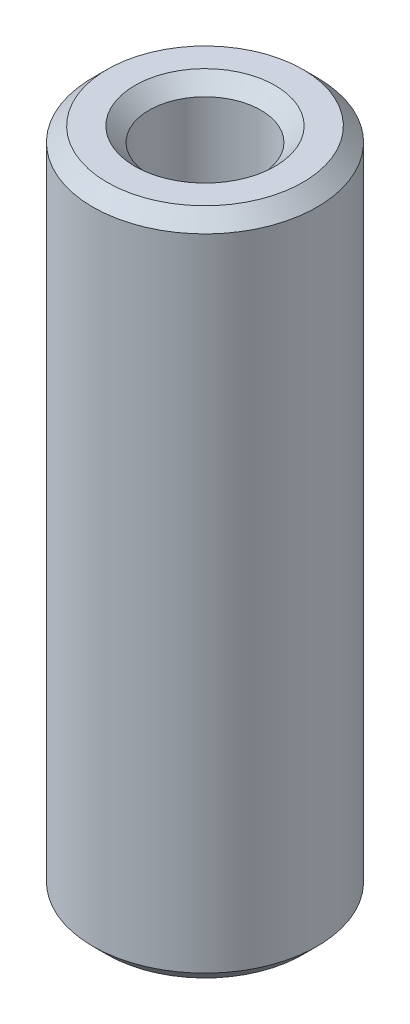
ISO-10303-21;
HEADER;
FILE_DESCRIPTION(('STEP AP214'),'2;1');
FILE_NAME('part.step','',(''),(''),'','','');
FILE_SCHEMA(('AUTOMOTIVE_DESIGN { 1 0 10303 214 1 1 1 1 }'));
ENDSEC;
DATA;
#1=APPLICATION_CONTEXT('core data for automotive mechanical design processes');
#2=APPLICATION_PROTOCOL_DEFINITION('international standard','automotive_design',2000,#1);
#3=PRODUCT_CONTEXT('',#1,'mechanical');
#4=PRODUCT('Part','Part','',(#3));
#5=PRODUCT_RELATED_PRODUCT_CATEGORY('part','',(#4));
#6=PRODUCT_DEFINITION_FORMATION('','',#4);
#7=PRODUCT_DEFINITION_CONTEXT('part definition',#1,'design');
#8=PRODUCT_DEFINITION('design','',#6,#7);
#9=PRODUCT_DEFINITION_SHAPE('','',#8);
#10=(LENGTH_UNIT() NAMED_UNIT(*) SI_UNIT(.MILLI.,.METRE.));
#11=(NAMED_UNIT(*) PLANE_ANGLE_UNIT() SI_UNIT($,.RADIAN.));
#12=(NAMED_UNIT(*) SI_UNIT($,.STERADIAN.) SOLID_ANGLE_UNIT());
#13=UNCERTAINTY_MEASURE_WITH_UNIT(LENGTH_MEASURE(1.E-05),#10,'distance_accuracy_value','');
#14=(GEOMETRIC_REPRESENTATION_CONTEXT(3) GLOBAL_UNCERTAINTY_ASSIGNED_CONTEXT((#13)) GLOBAL_UNIT_ASSIGNED_CONTEXT((#10,
#11,#12)) REPRESENTATION_CONTEXT('',''));
#15=CARTESIAN_POINT('',(0.,0.,0.));
#16=DIRECTION('',(0.,0.,1.));
#17=DIRECTION('',(1.,0.,0.));
#18=AXIS2_PLACEMENT_3D('',#15,#16,#17);
#19=CARTESIAN_POINT('',(0.,44.727620054621,0.));
#20=DIRECTION('',(0.,-1.,0.));
#21=DIRECTION('',(0.,0.,-1.));
#22=AXIS2_PLACEMENT_3D('',#19,#20,#21);
#23=CYLINDRICAL_SURFACE('',#22,7.5);
#24=CARTESIAN_POINT('',(0.,0.955096712856082,0.));
#25=DIRECTION('',(0.,1.,0.));
#26=DIRECTION('',(0.,0.,1.));
#27=AXIS2_PLACEMENT_3D('',#24,#25,#26);
#28=CIRCLE('',#27,7.5);
#29=CARTESIAN_POINT('',(0.,0.955096712856082,7.5));
#30=VERTEX_POINT('',#29);
#31=EDGE_CURVE('E10',#30,#30,#28,.T.);
#32=ORIENTED_EDGE('',*,*,#31,.T.);
#33=EDGE_LOOP('',(#32));
#34=FACE_BOUND('',#33,.T.);
#35=CARTESIAN_POINT('',(0.,43.7725233417649,0.));
#36=DIRECTION('',(0.,1.,0.));
#37=DIRECTION('',(0.,0.,1.));
#38=AXIS2_PLACEMENT_3D('',#35,#36,#37);
#39=CIRCLE('',#38,7.5);
#40=CARTESIAN_POINT('',(0.,43.7725233417649,7.5));
#41=VERTEX_POINT('',#40);
#42=EDGE_CURVE('E50',#41,#41,#39,.F.);
#43=ORIENTED_EDGE('',*,*,#42,.T.);
#44=EDGE_LOOP('',(#43));
#45=FACE_BOUND('',#44,.T.);
#46=ADVANCED_FACE('F39',(#34,#45),#23,.T.);
#47=CARTESIAN_POINT('',(0.,44.727620054621,0.));
#48=DIRECTION('',(0.,1.,0.));
#49=DIRECTION('',(0.,0.,1.));
#50=AXIS2_PLACEMENT_3D('',#47,#48,#49);
#51=PLANE('',#50);
#52=CARTESIAN_POINT('',(0.,44.727620054621,0.));
#53=DIRECTION('',(0.,1.,0.));
#54=DIRECTION('',(0.,0.,1.));
#55=AXIS2_PLACEMENT_3D('',#52,#53,#54);
#56=CIRCLE('',#55,4.68998011673796);
#57=CARTESIAN_POINT('',(0.,44.727620054621,4.68998011673796));
#58=VERTEX_POINT('',#57);
#59=EDGE_CURVE('E58',#58,#58,#56,.F.);
#60=ORIENTED_EDGE('',*,*,#59,.T.);
#61=EDGE_LOOP('',(#60));
#62=FACE_BOUND('',#61,.T.);
#63=CARTESIAN_POINT('',(0.,44.727620054621,0.));
#64=DIRECTION('',(0.,1.,0.));
#65=DIRECTION('',(0.,0.,1.));
#66=AXIS2_PLACEMENT_3D('',#63,#64,#65);
#67=CIRCLE('',#66,6.54490328714392);
#68=CARTESIAN_POINT('',(0.,44.727620054621,6.54490328714392));
#69=VERTEX_POINT('',#68);
#70=EDGE_CURVE('E61',#69,#69,#67,.T.);
#71=ORIENTED_EDGE('',*,*,#70,.T.);
#72=EDGE_LOOP('',(#71));
#73=FACE_BOUND('',#72,.T.);
#74=ADVANCED_FACE('F88',(#62,#73),#51,.T.);
#75=CARTESIAN_POINT('',(0.,0.,0.));
#76=DIRECTION('',(0.,1.,0.));
#77=DIRECTION('',(0.,0.,1.));
#78=AXIS2_PLACEMENT_3D('',#75,#76,#77);
#79=PLANE('',#78);
#80=CARTESIAN_POINT('',(0.,0.,0.));
#81=DIRECTION('',(0.,1.,0.));
#82=DIRECTION('',(0.,0.,1.));
#83=AXIS2_PLACEMENT_3D('',#80,#81,#82);
#84=CIRCLE('',#83,4.68998011673797);
#85=CARTESIAN_POINT('',(0.,0.,4.68998011673797));
#86=VERTEX_POINT('',#85);
#87=EDGE_CURVE('E51',#86,#86,#84,.T.);
#88=ORIENTED_EDGE('',*,*,#87,.T.);
#89=EDGE_LOOP('',(#88));
#90=FACE_BOUND('',#89,.T.);
#91=CARTESIAN_POINT('',(0.,0.,0.));
#92=DIRECTION('',(0.,1.,0.));
#93=DIRECTION('',(0.,0.,1.));
#94=AXIS2_PLACEMENT_3D('',#91,#92,#93);
#95=CIRCLE('',#94,6.54490328714391);
#96=CARTESIAN_POINT('',(0.,0.,6.54490328714391));
#97=VERTEX_POINT('',#96);
#98=EDGE_CURVE('E54',#97,#97,#95,.F.);
#99=ORIENTED_EDGE('',*,*,#98,.T.);
#100=EDGE_LOOP('',(#99));
#101=FACE_BOUND('',#100,.T.);
#102=ADVANCED_FACE('F83',(#90,#101),#79,.F.);
#103=CARTESIAN_POINT('',(0.,44.727620054621,0.));
#104=DIRECTION('',(0.,-1.,0.));
#105=DIRECTION('',(0.,0.,-1.));
#106=AXIS2_PLACEMENT_3D('',#103,#104,#105);
#107=CYLINDRICAL_SURFACE('',#106,3.7348834038819);
#108=CARTESIAN_POINT('',(0.,43.772523341765,0.));
#109=DIRECTION('',(0.,1.,0.));
#110=DIRECTION('',(0.,0.,1.));
#111=AXIS2_PLACEMENT_3D('',#108,#109,#110);
#112=CIRCLE('',#111,3.7348834038819);
#113=CARTESIAN_POINT('',(0.,43.772523341765,3.73488340388189));
#114=VERTEX_POINT('',#113);
#115=EDGE_CURVE('E67',#114,#114,#112,.T.);
#116=ORIENTED_EDGE('',*,*,#115,.T.);
#117=EDGE_LOOP('',(#116));
#118=FACE_BOUND('',#117,.T.);
#119=CARTESIAN_POINT('',(0.,0.955096712856089,0.));
#120=DIRECTION('',(0.,1.,0.));
#121=DIRECTION('',(0.,0.,1.));
#122=AXIS2_PLACEMENT_3D('',#119,#120,#121);
#123=CIRCLE('',#122,3.7348834038819);
#124=CARTESIAN_POINT('',(0.,0.955096712856089,3.7348834038819));
#125=VERTEX_POINT('',#124);
#126=EDGE_CURVE('E69',#125,#125,#123,.F.);
#127=ORIENTED_EDGE('',*,*,#126,.T.);
#128=EDGE_LOOP('',(#127));
#129=FACE_BOUND('',#128,.T.);
#130=ADVANCED_FACE('F71',(#118,#129),#107,.F.);
#131=CARTESIAN_POINT('',(0.,43.772523341765,0.));
#132=DIRECTION('',(0.,1.,0.));
#133=DIRECTION('',(0.,0.,1.));
#134=AXIS2_PLACEMENT_3D('',#131,#132,#133);
#135=CONICAL_SURFACE('',#134,3.7348834038819,0.785398163397447);
#136=CARTESIAN_POINT('',(0.,44.727620054621,4.68998011673796));
#137=CARTESIAN_POINT('',(0.,44.7176711305288,4.68003119264571));
#138=CARTESIAN_POINT('',(0.,44.7077222064365,4.67008226855346));
#139=CARTESIAN_POINT('',(0.,44.687824358252,4.65018442036896));
#140=CARTESIAN_POINT('',(0.,44.6778754341598,4.6402354962767));
#141=CARTESIAN_POINT('',(0.,44.6579775859753,4.6203376480922));
#142=CARTESIAN_POINT('',(0.,44.648028661883,4.61038872399995));
#143=CARTESIAN_POINT('',(0.,44.6281308136985,4.59049087581545));
#144=CARTESIAN_POINT('',(0.,44.6181818896063,4.5805419517232));
#145=CARTESIAN_POINT('',(0.,44.5982840414218,4.5606441035387));
#146=CARTESIAN_POINT('',(0.,44.5883351173295,4.55069517944645));
#147=CARTESIAN_POINT('',(0.,44.568437269145,4.53079733126195));
#148=CARTESIAN_POINT('',(0.,44.5584883450528,4.5208484071697));
#149=CARTESIAN_POINT('',(0.,44.5385904968683,4.5009505589852));
#150=CARTESIAN_POINT('',(0.,44.528641572776,4.49100163489294));
#151=CARTESIAN_POINT('',(0.,44.5087437245915,4.47110378670844));
#152=CARTESIAN_POINT('',(0.,44.4987948004993,4.46115486261619));
#153=CARTESIAN_POINT('',(0.,44.4788969523147,4.44125701443169));
#154=CARTESIAN_POINT('',(0.,44.4689480282225,4.43130809033944));
#155=CARTESIAN_POINT('',(0.,44.449050180038,4.41141024215494));
#156=CARTESIAN_POINT('',(0.,44.4391012559458,4.40146131806269));
#157=CARTESIAN_POINT('',(0.,44.4192034077613,4.38156346987819));
#158=CARTESIAN_POINT('',(0.,44.409254483669,4.37161454578594));
#159=CARTESIAN_POINT('',(0.,44.3893566354845,4.35171669760144));
#160=CARTESIAN_POINT('',(0.,44.3794077113922,4.34176777350919));
#161=CARTESIAN_POINT('',(0.,44.3595098632077,4.32186992532468));
#162=CARTESIAN_POINT('',(0.,44.3495609391155,4.31192100123243));
#163=CARTESIAN_POINT('',(0.,44.329663090931,4.29202315304793));
#164=CARTESIAN_POINT('',(0.,44.3197141668387,4.28207422895568));
#165=CARTESIAN_POINT('',(0.,44.2998163186542,4.26217638077118));
#166=CARTESIAN_POINT('',(0.,44.289867394562,4.25222745667893));
#167=CARTESIAN_POINT('',(0.,44.2699695463775,4.23232960849443));
#168=CARTESIAN_POINT('',(0.,44.2600206222852,4.22238068440218));
#169=CARTESIAN_POINT('',(0.,44.2401227741007,4.20248283621768));
#170=CARTESIAN_POINT('',(0.,44.2301738500085,4.19253391212543));
#171=CARTESIAN_POINT('',(0.,44.210276001824,4.17263606394092));
#172=CARTESIAN_POINT('',(0.,44.2003270777317,4.16268713984867));
#173=CARTESIAN_POINT('',(0.,44.1804292295472,4.14278929166417));
#174=CARTESIAN_POINT('',(0.,44.170480305455,4.13284036757192));
#175=CARTESIAN_POINT('',(0.,44.1505824572705,4.11294251938742));
#176=CARTESIAN_POINT('',(0.,44.1406335331782,4.10299359529517));
#177=CARTESIAN_POINT('',(0.,44.1207356849937,4.08309574711067));
#178=CARTESIAN_POINT('',(0.,44.1107867609015,4.07314682301842));
#179=CARTESIAN_POINT('',(0.,44.090888912717,4.05324897483391));
#180=CARTESIAN_POINT('',(0.,44.0809399886247,4.04330005074166));
#181=CARTESIAN_POINT('',(0.,44.0610421404402,4.02340220255716));
#182=CARTESIAN_POINT('',(0.,44.051093216348,4.01345327846491));
#183=CARTESIAN_POINT('',(0.,44.0311953681635,3.99355543028041));
#184=CARTESIAN_POINT('',(0.,44.0212464440712,3.98360650618816));
#185=CARTESIAN_POINT('',(0.,44.0013485958867,3.96370865800366));
#186=CARTESIAN_POINT('',(0.,43.9913996717945,3.95375973391141));
#187=CARTESIAN_POINT('',(0.,43.97150182361,3.93386188572691));
#188=CARTESIAN_POINT('',(0.,43.9615528995177,3.92391296163466));
#189=CARTESIAN_POINT('',(0.,43.9416550513332,3.90401511345015));
#190=CARTESIAN_POINT('',(0.,43.931706127241,3.8940661893579));
#191=CARTESIAN_POINT('',(0.,43.9118082790565,3.8741683411734));
#192=CARTESIAN_POINT('',(0.,43.9018593549642,3.86421941708115));
#193=CARTESIAN_POINT('',(0.,43.8819615067797,3.84432156889665));
#194=CARTESIAN_POINT('',(0.,43.8720125826875,3.8343726448044));
#195=CARTESIAN_POINT('',(0.,43.852114734503,3.8144747966199));
#196=CARTESIAN_POINT('',(0.,43.8421658104107,3.80452587252765));
#197=CARTESIAN_POINT('',(0.,43.8222679622262,3.78462802434315));
#198=CARTESIAN_POINT('',(0.,43.812319038134,3.7746791002509));
#199=CARTESIAN_POINT('',(0.,43.7924211899495,3.75478125206639));
#200=CARTESIAN_POINT('',(0.,43.7824722658572,3.74483232797414));
#201=CARTESIAN_POINT('',(0.,43.772523341765,3.73488340388189));
#202=B_SPLINE_CURVE_WITH_KNOTS('',3,(#136,#137,#138,#139,#140,#141,#142,#143,#144,#145,#146,
#147,#148,#149,#150,#151,#152,#153,#154,#155,#156,#157,#158,#159,#160,#161,#162,#163,#164,#165,
#166,#167,#168,#169,#170,#171,#172,#173,#174,#175,#176,#177,#178,#179,#180,#181,#182,#183,#184,
#185,#186,#187,#188,#189,#190,#191,#192,#193,#194,#195,#196,#197,#198,#199,#200,#201),
.UNSPECIFIED.,.F.,.F.,(4,2,2,2,2,2,2,2,2,2,2,2,2,2,2,2,2,2,2,2,2,2,2,2,2,2,2,2,2,2,2,2,4),(0.,
0.0422097101468423,0.0844194202936847,0.126629130440532,0.168838840587374,0.211048550734217,
0.253258260881064,0.295467971027906,0.337677681174753,0.379887391321595,0.422097101468437,
0.464306811615285,0.506516521762127,0.548726231908969,0.590935942055816,0.633145652202659,
0.675355362349506,0.717565072496348,0.759774782643191,0.801984492790038,0.84419420293688,
0.886403913083723,0.92861362323057,0.970823333377412,1.01303304352426,1.0552427536711,
1.09745246381794,1.13966217396479,1.18187188411163,1.22408159425848,1.26629130440532,
1.30850101455216,1.35071072469901),.UNSPECIFIED.);
#203=EDGE_CURVE('BSEAM77',#58,#114,#202,.T.);
#204=ORIENTED_EDGE('',*,*,#59,.F.);
#205=ORIENTED_EDGE('',*,*,#115,.F.);
#206=ORIENTED_EDGE('',*,*,#203,.T.);
#207=ORIENTED_EDGE('',*,*,#203,.F.);
#208=EDGE_LOOP('',(#204,#206,#205,#207));
#209=FACE_BOUND('',#208,.T.);
#210=ADVANCED_FACE('F77',(#209),#135,.F.);
#211=CARTESIAN_POINT('',(0.,0.,0.));
#212=DIRECTION('',(0.,-1.,0.));
#213=DIRECTION('',(0.,0.,-1.));
#214=AXIS2_PLACEMENT_3D('',#211,#212,#213);
#215=CONICAL_SURFACE('',#214,4.68998011673797,0.78539816339744);
#216=ORIENTED_EDGE('',*,*,#126,.F.);
#217=EDGE_LOOP('',(#216));
#218=FACE_BOUND('',#217,.T.);
#219=ORIENTED_EDGE('',*,*,#87,.F.);
#220=EDGE_LOOP('',(#219));
#221=FACE_BOUND('',#220,.T.);
#222=ADVANCED_FACE('F73',(#218,#221),#215,.F.);
#223=CARTESIAN_POINT('',(0.,0.955096712856082,0.));
#224=DIRECTION('',(0.,1.,0.));
#225=DIRECTION('',(0.,0.,1.));
#226=AXIS2_PLACEMENT_3D('',#223,#224,#225);
#227=CONICAL_SURFACE('',#226,7.5,0.78539816339745);
#228=ORIENTED_EDGE('',*,*,#98,.F.);
#229=EDGE_LOOP('',(#228));
#230=FACE_BOUND('',#229,.T.);
#231=ORIENTED_EDGE('',*,*,#31,.F.);
#232=EDGE_LOOP('',(#231));
#233=FACE_BOUND('',#232,.T.);
#234=ADVANCED_FACE('F76',(#230,#233),#227,.T.);
#235=CARTESIAN_POINT('',(0.,44.727620054621,0.));
#236=DIRECTION('',(0.,-1.,0.));
#237=DIRECTION('',(0.,0.,-1.));
#238=AXIS2_PLACEMENT_3D('',#235,#236,#237);
#239=CONICAL_SURFACE('',#238,6.54490328714392,0.785398163397441);
#240=ORIENTED_EDGE('',*,*,#42,.F.);
#241=EDGE_LOOP('',(#240));
#242=FACE_BOUND('',#241,.T.);
#243=ORIENTED_EDGE('',*,*,#70,.F.);
#244=EDGE_LOOP('',(#243));
#245=FACE_BOUND('',#244,.T.);
#246=ADVANCED_FACE('F45',(#242,#245),#239,.T.);
#247=CLOSED_SHELL('',(#46,#74,#102,#130,#210,#222,#234,#246));
#248=MANIFOLD_SOLID_BREP('B2',#247);
#249=ADVANCED_BREP_SHAPE_REPRESENTATION('',(#18,#248),#14);
#250=SHAPE_DEFINITION_REPRESENTATION(#9,#249);
ENDSEC;
END-ISO-10303-21;
